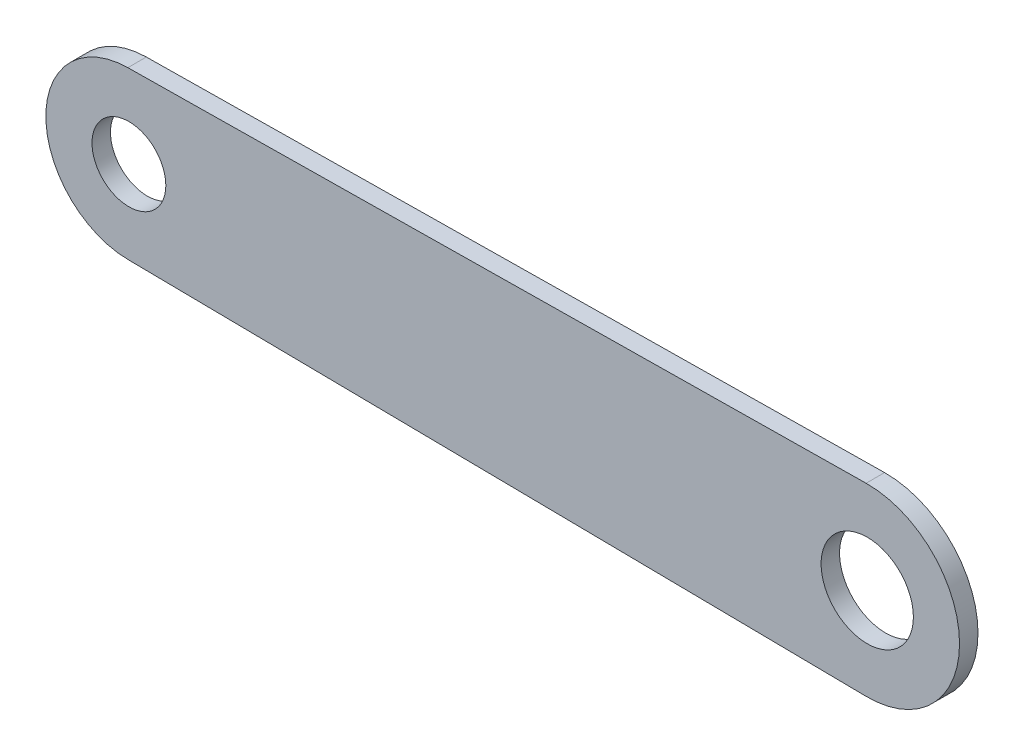
ISO-10303-21;
HEADER;
FILE_DESCRIPTION(('STEP AP214'),'2;1');
FILE_NAME('part.step','',(''),(''),'','','');
FILE_SCHEMA(('AUTOMOTIVE_DESIGN { 1 0 10303 214 1 1 1 1 }'));
ENDSEC;
DATA;
#1=APPLICATION_CONTEXT('core data for automotive mechanical design processes');
#2=APPLICATION_PROTOCOL_DEFINITION('international standard','automotive_design',2000,#1);
#3=PRODUCT_CONTEXT('',#1,'mechanical');
#4=PRODUCT('Part','Part','',(#3));
#5=PRODUCT_RELATED_PRODUCT_CATEGORY('part','',(#4));
#6=PRODUCT_DEFINITION_FORMATION('','',#4);
#7=PRODUCT_DEFINITION_CONTEXT('part definition',#1,'design');
#8=PRODUCT_DEFINITION('design','',#6,#7);
#9=PRODUCT_DEFINITION_SHAPE('','',#8);
#10=(LENGTH_UNIT() NAMED_UNIT(*) SI_UNIT(.MILLI.,.METRE.));
#11=(NAMED_UNIT(*) PLANE_ANGLE_UNIT() SI_UNIT($,.RADIAN.));
#12=(NAMED_UNIT(*) SI_UNIT($,.STERADIAN.) SOLID_ANGLE_UNIT());
#13=UNCERTAINTY_MEASURE_WITH_UNIT(LENGTH_MEASURE(1.E-05),#10,'distance_accuracy_value','');
#14=(GEOMETRIC_REPRESENTATION_CONTEXT(3) GLOBAL_UNCERTAINTY_ASSIGNED_CONTEXT((#13)) GLOBAL_UNIT_ASSIGNED_CONTEXT((#10,
#11,#12)) REPRESENTATION_CONTEXT('',''));
#15=CARTESIAN_POINT('',(0.,0.,0.));
#16=DIRECTION('',(0.,0.,1.));
#17=DIRECTION('',(1.,0.,0.));
#18=AXIS2_PLACEMENT_3D('',#15,#16,#17);
#19=CARTESIAN_POINT('',(-160.,0.,-4.));
#20=DIRECTION('',(0.,0.,1.));
#21=DIRECTION('',(1.,0.,0.));
#22=AXIS2_PLACEMENT_3D('',#19,#20,#21);
#23=CYLINDRICAL_SURFACE('',#22,18.);
#24=CARTESIAN_POINT('',(-160.,0.,0.));
#25=DIRECTION('',(0.,0.,1.));
#26=DIRECTION('',(1.,0.,0.));
#27=AXIS2_PLACEMENT_3D('',#24,#25,#26);
#28=CIRCLE('',#27,18.);
#29=CARTESIAN_POINT('',(-160.225000000001,17.9985936950642,0.));
#30=VERTEX_POINT('',#29);
#31=CARTESIAN_POINT('',(-160.225000000001,-17.9985936950639,0.));
#32=VERTEX_POINT('',#31);
#33=EDGE_CURVE('E99',#30,#32,#28,.T.);
#34=ORIENTED_EDGE('',*,*,#33,.F.);
#35=DIRECTION('',(0.,0.,1.));
#36=VECTOR('',#35,1.);
#37=CARTESIAN_POINT('',(-160.225000000001,17.9985936950642,-4.));
#38=LINE('',#37,#36);
#39=CARTESIAN_POINT('',(-160.225000000001,17.9985936950642,-4.));
#40=VERTEX_POINT('',#39);
#41=EDGE_CURVE('E11',#40,#30,#38,.T.);
#42=ORIENTED_EDGE('',*,*,#41,.F.);
#43=CARTESIAN_POINT('',(-160.,0.,-4.));
#44=DIRECTION('',(0.,0.,1.));
#45=DIRECTION('',(1.,0.,0.));
#46=AXIS2_PLACEMENT_3D('',#43,#44,#45);
#47=CIRCLE('',#46,18.);
#48=CARTESIAN_POINT('',(-160.225000000001,-17.9985936950639,-4.));
#49=VERTEX_POINT('',#48);
#50=EDGE_CURVE('E92',#40,#49,#47,.T.);
#51=ORIENTED_EDGE('',*,*,#50,.T.);
#52=DIRECTION('',(0.,0.,1.));
#53=VECTOR('',#52,1.);
#54=CARTESIAN_POINT('',(-160.225000000001,-17.9985936950639,-4.));
#55=LINE('',#54,#53);
#56=EDGE_CURVE('E37',#49,#32,#55,.T.);
#57=ORIENTED_EDGE('',*,*,#56,.T.);
#58=EDGE_LOOP('',(#34,#42,#51,#57));
#59=FACE_BOUND('',#58,.T.);
#60=ADVANCED_FACE('F34',(#59),#23,.T.);
#61=CARTESIAN_POINT('',(-160.225000000001,17.9985936950642,-4.));
#62=DIRECTION('',(-0.0125000000000001,0.999921871948005,0.));
#63=DIRECTION('',(-0.999921871948005,-0.0125000000000001,0.));
#64=AXIS2_PLACEMENT_3D('',#61,#62,#63);
#65=PLANE('',#64);
#66=DIRECTION('',(-0.999921871948005,-0.0125000000000001,0.));
#67=VECTOR('',#66,1.);
#68=CARTESIAN_POINT('',(-160.225000000001,17.9985936950642,0.));
#69=LINE('',#68,#67);
#70=CARTESIAN_POINT('',(-0.249999999999861,19.9984374389602,0.));
#71=VERTEX_POINT('',#70);
#72=EDGE_CURVE('E94',#71,#30,#69,.T.);
#73=ORIENTED_EDGE('',*,*,#72,.F.);
#74=DIRECTION('',(0.,0.,1.));
#75=VECTOR('',#74,1.);
#76=CARTESIAN_POINT('',(-0.249999999999861,19.9984374389602,-4.));
#77=LINE('',#76,#75);
#78=CARTESIAN_POINT('',(-0.249999999999861,19.9984374389602,-4.));
#79=VERTEX_POINT('',#78);
#80=EDGE_CURVE('E43',#79,#71,#77,.T.);
#81=ORIENTED_EDGE('',*,*,#80,.F.);
#82=DIRECTION('',(-0.999921871948005,-0.0125000000000001,0.));
#83=VECTOR('',#82,1.);
#84=CARTESIAN_POINT('',(-160.225000000001,17.9985936950642,-4.));
#85=LINE('',#84,#83);
#86=EDGE_CURVE('E89',#79,#40,#85,.T.);
#87=ORIENTED_EDGE('',*,*,#86,.T.);
#88=ORIENTED_EDGE('',*,*,#41,.T.);
#89=EDGE_LOOP('',(#73,#81,#87,#88));
#90=FACE_BOUND('',#89,.T.);
#91=ADVANCED_FACE('F110',(#90),#65,.T.);
#92=CARTESIAN_POINT('',(0.,0.,-4.));
#93=DIRECTION('',(0.,0.,1.));
#94=DIRECTION('',(1.,0.,0.));
#95=AXIS2_PLACEMENT_3D('',#92,#93,#94);
#96=CYLINDRICAL_SURFACE('',#95,20.);
#97=CARTESIAN_POINT('',(0.,0.,0.));
#98=DIRECTION('',(0.,0.,1.));
#99=DIRECTION('',(1.,0.,0.));
#100=AXIS2_PLACEMENT_3D('',#97,#98,#99);
#101=CIRCLE('',#100,20.);
#102=CARTESIAN_POINT('',(-0.250000000000306,-19.9984374389596,0.));
#103=VERTEX_POINT('',#102);
#104=EDGE_CURVE('E84',#103,#71,#101,.T.);
#105=ORIENTED_EDGE('',*,*,#104,.F.);
#106=DIRECTION('',(0.,0.,1.));
#107=VECTOR('',#106,1.);
#108=CARTESIAN_POINT('',(-0.250000000000306,-19.9984374389596,-4.));
#109=LINE('',#108,#107);
#110=CARTESIAN_POINT('',(-0.250000000000306,-19.9984374389596,-4.));
#111=VERTEX_POINT('',#110);
#112=EDGE_CURVE('E79',#111,#103,#109,.T.);
#113=ORIENTED_EDGE('',*,*,#112,.F.);
#114=CARTESIAN_POINT('',(0.,0.,-4.));
#115=DIRECTION('',(0.,0.,1.));
#116=DIRECTION('',(1.,0.,0.));
#117=AXIS2_PLACEMENT_3D('',#114,#115,#116);
#118=CIRCLE('',#117,20.);
#119=EDGE_CURVE('E82',#111,#79,#118,.T.);
#120=ORIENTED_EDGE('',*,*,#119,.T.);
#121=ORIENTED_EDGE('',*,*,#80,.T.);
#122=EDGE_LOOP('',(#105,#113,#120,#121));
#123=FACE_BOUND('',#122,.T.);
#124=ADVANCED_FACE('F81',(#123),#96,.T.);
#125=CARTESIAN_POINT('',(-0.250000000000306,-19.9984374389596,-4.));
#126=DIRECTION('',(-0.0125000000000001,-0.999921871948004,0.));
#127=DIRECTION('',(0.999921871948004,-0.0125000000000001,0.));
#128=AXIS2_PLACEMENT_3D('',#125,#126,#127);
#129=PLANE('',#128);
#130=DIRECTION('',(0.999921871948004,-0.0125000000000001,0.));
#131=VECTOR('',#130,1.);
#132=CARTESIAN_POINT('',(-0.250000000000306,-19.9984374389596,0.));
#133=LINE('',#132,#131);
#134=EDGE_CURVE('E102',#32,#103,#133,.T.);
#135=ORIENTED_EDGE('',*,*,#134,.F.);
#136=ORIENTED_EDGE('',*,*,#56,.F.);
#137=DIRECTION('',(0.999921871948004,-0.0125000000000001,0.));
#138=VECTOR('',#137,1.);
#139=CARTESIAN_POINT('',(-0.250000000000306,-19.9984374389596,-4.));
#140=LINE('',#139,#138);
#141=EDGE_CURVE('E88',#49,#111,#140,.T.);
#142=ORIENTED_EDGE('',*,*,#141,.T.);
#143=ORIENTED_EDGE('',*,*,#112,.T.);
#144=EDGE_LOOP('',(#135,#136,#142,#143));
#145=FACE_BOUND('',#144,.T.);
#146=ADVANCED_FACE('F91',(#145),#129,.T.);
#147=CARTESIAN_POINT('',(-160.,0.,-4.));
#148=DIRECTION('',(0.,0.,1.));
#149=DIRECTION('',(1.,0.,0.));
#150=AXIS2_PLACEMENT_3D('',#147,#148,#149);
#151=PLANE('',#150);
#152=CARTESIAN_POINT('',(0.,0.,-4.));
#153=DIRECTION('',(0.,0.,1.));
#154=DIRECTION('',(1.,0.,0.));
#155=AXIS2_PLACEMENT_3D('',#152,#153,#154);
#156=CIRCLE('',#155,10.);
#157=CARTESIAN_POINT('',(10.,0.,-4.));
#158=VERTEX_POINT('',#157);
#159=EDGE_CURVE('E143',#158,#158,#156,.T.);
#160=ORIENTED_EDGE('',*,*,#159,.T.);
#161=EDGE_LOOP('',(#160));
#162=FACE_BOUND('',#161,.T.);
#163=CARTESIAN_POINT('',(-160.,0.,-4.));
#164=DIRECTION('',(0.,0.,1.));
#165=DIRECTION('',(1.,0.,0.));
#166=AXIS2_PLACEMENT_3D('',#163,#164,#165);
#167=CIRCLE('',#166,7.99999999999998);
#168=CARTESIAN_POINT('',(-152.,0.,-4.));
#169=VERTEX_POINT('',#168);
#170=EDGE_CURVE('E103',#169,#169,#167,.T.);
#171=ORIENTED_EDGE('',*,*,#170,.T.);
#172=EDGE_LOOP('',(#171));
#173=FACE_BOUND('',#172,.T.);
#174=ORIENTED_EDGE('',*,*,#50,.F.);
#175=ORIENTED_EDGE('',*,*,#86,.F.);
#176=ORIENTED_EDGE('',*,*,#119,.F.);
#177=ORIENTED_EDGE('',*,*,#141,.F.);
#178=EDGE_LOOP('',(#174,#175,#176,#177));
#179=FACE_BOUND('',#178,.T.);
#180=ADVANCED_FACE('F87',(#162,#173,#179),#151,.F.);
#181=CARTESIAN_POINT('',(-160.,0.,0.));
#182=DIRECTION('',(0.,0.,1.));
#183=DIRECTION('',(1.,0.,0.));
#184=AXIS2_PLACEMENT_3D('',#181,#182,#183);
#185=PLANE('',#184);
#186=CARTESIAN_POINT('',(0.,0.,0.));
#187=DIRECTION('',(0.,0.,1.));
#188=DIRECTION('',(1.,0.,0.));
#189=AXIS2_PLACEMENT_3D('',#186,#187,#188);
#190=CIRCLE('',#189,10.);
#191=CARTESIAN_POINT('',(10.,0.,0.));
#192=VERTEX_POINT('',#191);
#193=EDGE_CURVE('E146',#192,#192,#190,.T.);
#194=ORIENTED_EDGE('',*,*,#193,.F.);
#195=EDGE_LOOP('',(#194));
#196=FACE_BOUND('',#195,.T.);
#197=CARTESIAN_POINT('',(-160.,0.,0.));
#198=DIRECTION('',(0.,0.,1.));
#199=DIRECTION('',(1.,0.,0.));
#200=AXIS2_PLACEMENT_3D('',#197,#198,#199);
#201=CIRCLE('',#200,7.99999999999998);
#202=CARTESIAN_POINT('',(-152.,0.,0.));
#203=VERTEX_POINT('',#202);
#204=EDGE_CURVE('E148',#203,#203,#201,.T.);
#205=ORIENTED_EDGE('',*,*,#204,.F.);
#206=EDGE_LOOP('',(#205));
#207=FACE_BOUND('',#206,.T.);
#208=ORIENTED_EDGE('',*,*,#33,.T.);
#209=ORIENTED_EDGE('',*,*,#134,.T.);
#210=ORIENTED_EDGE('',*,*,#104,.T.);
#211=ORIENTED_EDGE('',*,*,#72,.T.);
#212=EDGE_LOOP('',(#208,#209,#210,#211));
#213=FACE_BOUND('',#212,.T.);
#214=ADVANCED_FACE('F109',(#196,#207,#213),#185,.T.);
#215=CARTESIAN_POINT('',(-160.,0.,-4.));
#216=DIRECTION('',(0.,0.,1.));
#217=DIRECTION('',(1.,0.,0.));
#218=AXIS2_PLACEMENT_3D('',#215,#216,#217);
#219=CYLINDRICAL_SURFACE('',#218,7.99999999999998);
#220=ORIENTED_EDGE('',*,*,#170,.F.);
#221=EDGE_LOOP('',(#220));
#222=FACE_BOUND('',#221,.T.);
#223=ORIENTED_EDGE('',*,*,#204,.T.);
#224=EDGE_LOOP('',(#223));
#225=FACE_BOUND('',#224,.T.);
#226=ADVANCED_FACE('F128',(#222,#225),#219,.F.);
#227=CARTESIAN_POINT('',(0.,0.,-4.));
#228=DIRECTION('',(0.,0.,1.));
#229=DIRECTION('',(1.,0.,0.));
#230=AXIS2_PLACEMENT_3D('',#227,#228,#229);
#231=CYLINDRICAL_SURFACE('',#230,10.);
#232=ORIENTED_EDGE('',*,*,#159,.F.);
#233=EDGE_LOOP('',(#232));
#234=FACE_BOUND('',#233,.T.);
#235=ORIENTED_EDGE('',*,*,#193,.T.);
#236=EDGE_LOOP('',(#235));
#237=FACE_BOUND('',#236,.T.);
#238=ADVANCED_FACE('F135',(#234,#237),#231,.F.);
#239=CLOSED_SHELL('',(#60,#91,#124,#146,#180,#214,#226,#238));
#240=MANIFOLD_SOLID_BREP('B2',#239);
#241=ADVANCED_BREP_SHAPE_REPRESENTATION('',(#18,#240),#14);
#242=SHAPE_DEFINITION_REPRESENTATION(#9,#241);
ENDSEC;
END-ISO-10303-21;
